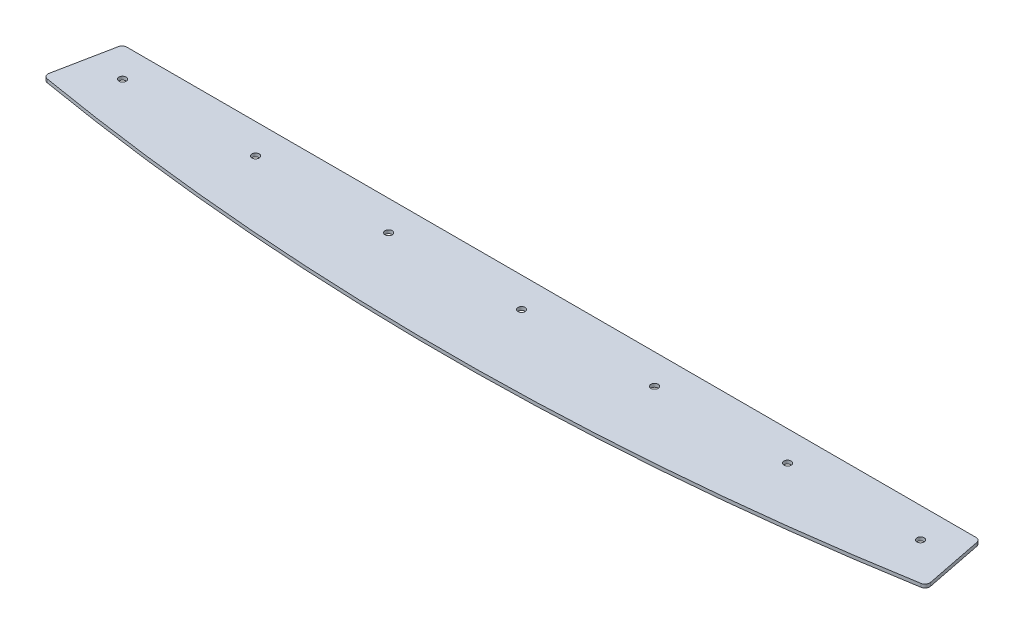
ISO-10303-21;
HEADER;
FILE_DESCRIPTION(('STEP AP214'),'2;1');
FILE_NAME('part.step','',(''),(''),'','','');
FILE_SCHEMA(('AUTOMOTIVE_DESIGN { 1 0 10303 214 1 1 1 1 }'));
ENDSEC;
DATA;
#1=APPLICATION_CONTEXT('core data for automotive mechanical design processes');
#2=APPLICATION_PROTOCOL_DEFINITION('international standard','automotive_design',2000,#1);
#3=PRODUCT_CONTEXT('',#1,'mechanical');
#4=PRODUCT('Part','Part','',(#3));
#5=PRODUCT_RELATED_PRODUCT_CATEGORY('part','',(#4));
#6=PRODUCT_DEFINITION_FORMATION('','',#4);
#7=PRODUCT_DEFINITION_CONTEXT('part definition',#1,'design');
#8=PRODUCT_DEFINITION('design','',#6,#7);
#9=PRODUCT_DEFINITION_SHAPE('','',#8);
#10=(LENGTH_UNIT() NAMED_UNIT(*) SI_UNIT(.MILLI.,.METRE.));
#11=(NAMED_UNIT(*) PLANE_ANGLE_UNIT() SI_UNIT($,.RADIAN.));
#12=(NAMED_UNIT(*) SI_UNIT($,.STERADIAN.) SOLID_ANGLE_UNIT());
#13=UNCERTAINTY_MEASURE_WITH_UNIT(LENGTH_MEASURE(1.E-05),#10,'distance_accuracy_value','');
#14=(GEOMETRIC_REPRESENTATION_CONTEXT(3) GLOBAL_UNCERTAINTY_ASSIGNED_CONTEXT((#13)) GLOBAL_UNIT_ASSIGNED_CONTEXT((#10,
#11,#12)) REPRESENTATION_CONTEXT('',''));
#15=CARTESIAN_POINT('',(0.,0.,0.));
#16=DIRECTION('',(0.,0.,1.));
#17=DIRECTION('',(1.,0.,0.));
#18=AXIS2_PLACEMENT_3D('',#15,#16,#17);
#19=CARTESIAN_POINT('',(2.77555756156289E-13,2.8,-1.99840144432528E-11));
#20=DIRECTION('',(0.,1.,0.));
#21=DIRECTION('',(0.,0.,1.));
#22=AXIS2_PLACEMENT_3D('',#19,#20,#21);
#23=PLANE('',#22);
#24=CARTESIAN_POINT('',(-220.,2.8,2088.42305009828));
#25=DIRECTION('',(0.,1.,0.));
#26=DIRECTION('',(0.,0.,1.));
#27=AXIS2_PLACEMENT_3D('',#24,#25,#26);
#28=CIRCLE('',#27,2.99999999999993);
#29=CARTESIAN_POINT('',(-220.,2.8,2091.42305009828));
#30=VERTEX_POINT('',#29);
#31=EDGE_CURVE('E207',#30,#30,#28,.T.);
#32=ORIENTED_EDGE('',*,*,#31,.F.);
#33=EDGE_LOOP('',(#32));
#34=FACE_BOUND('',#33,.T.);
#35=CARTESIAN_POINT('',(330.,2.8,2088.42305009828));
#36=DIRECTION('',(0.,1.,0.));
#37=DIRECTION('',(0.,0.,1.));
#38=AXIS2_PLACEMENT_3D('',#35,#36,#37);
#39=CIRCLE('',#38,2.99999999999993);
#40=CARTESIAN_POINT('',(330.,2.8,2091.42305009828));
#41=VERTEX_POINT('',#40);
#42=EDGE_CURVE('E195',#41,#41,#39,.T.);
#43=ORIENTED_EDGE('',*,*,#42,.F.);
#44=EDGE_LOOP('',(#43));
#45=FACE_BOUND('',#44,.T.);
#46=CARTESIAN_POINT('',(110.,2.8,2088.42305009828));
#47=DIRECTION('',(0.,1.,0.));
#48=DIRECTION('',(0.,0.,1.));
#49=AXIS2_PLACEMENT_3D('',#46,#47,#48);
#50=CIRCLE('',#49,2.99999999999994);
#51=CARTESIAN_POINT('',(110.,2.8,2091.42305009828));
#52=VERTEX_POINT('',#51);
#53=EDGE_CURVE('E184',#52,#52,#50,.T.);
#54=ORIENTED_EDGE('',*,*,#53,.F.);
#55=EDGE_LOOP('',(#54));
#56=FACE_BOUND('',#55,.T.);
#57=DIRECTION('',(-1.,0.,0.));
#58=VECTOR('',#57,1.);
#59=CARTESIAN_POINT('',(-354.423555472873,2.8,2063.72823661999));
#60=LINE('',#59,#58);
#61=CARTESIAN_POINT('',(351.140840309559,2.8,2063.72823661999));
#62=VERTEX_POINT('',#61);
#63=CARTESIAN_POINT('',(-351.140840309558,2.8,2063.72823661999));
#64=VERTEX_POINT('',#63);
#65=EDGE_CURVE('E170',#62,#64,#60,.T.);
#66=ORIENTED_EDGE('',*,*,#65,.T.);
#67=CARTESIAN_POINT('',(-351.140840309558,2.8,2067.72823661999));
#68=DIRECTION('',(0.,1.,0.));
#69=DIRECTION('',(0.,0.,1.));
#70=AXIS2_PLACEMENT_3D('',#67,#68,#69);
#71=CIRCLE('',#70,4.);
#72=CARTESIAN_POINT('',(-355.063981431171,2.8,2066.94787533193));
#73=VERTEX_POINT('',#72);
#74=EDGE_CURVE('E148',#64,#73,#71,.T.);
#75=ORIENTED_EDGE('',*,*,#74,.T.);
#76=DIRECTION('',(-0.195090322016128,0.,0.98078528040323));
#77=VECTOR('',#76,1.);
#78=CARTESIAN_POINT('',(-354.423555472873,2.8,2063.72823661999));
#79=LINE('',#78,#77);
#80=CARTESIAN_POINT('',(-364.562383916996,2.8,2114.69956926102));
#81=VERTEX_POINT('',#80);
#82=EDGE_CURVE('E118',#73,#81,#79,.T.);
#83=ORIENTED_EDGE('',*,*,#82,.T.);
#84=CARTESIAN_POINT('',(-360.639242795383,2.8,2115.47993054909));
#85=DIRECTION('',(0.,1.,0.));
#86=DIRECTION('',(0.,0.,1.));
#87=AXIS2_PLACEMENT_3D('',#84,#85,#86);
#88=CIRCLE('',#87,4.);
#89=CARTESIAN_POINT('',(-361.311450144489,2.8,2119.42304318758));
#90=VERTEX_POINT('',#89);
#91=EDGE_CURVE('E54',#81,#90,#88,.T.);
#92=ORIENTED_EDGE('',*,*,#91,.T.);
#93=CARTESIAN_POINT('',(2.77555756156289E-13,2.8,-1.99840144432528E-11));
#94=DIRECTION('',(0.,1.,0.));
#95=DIRECTION('',(0.,0.,1.));
#96=AXIS2_PLACEMENT_3D('',#93,#94,#95);
#97=CIRCLE('',#96,2150.00000000002);
#98=CARTESIAN_POINT('',(361.31145014449,2.8,2119.42304318758));
#99=VERTEX_POINT('',#98);
#100=EDGE_CURVE('E134',#90,#99,#97,.T.);
#101=ORIENTED_EDGE('',*,*,#100,.T.);
#102=CARTESIAN_POINT('',(360.639242795384,2.8,2115.47993054909));
#103=DIRECTION('',(0.,1.,0.));
#104=DIRECTION('',(0.,0.,1.));
#105=AXIS2_PLACEMENT_3D('',#102,#103,#104);
#106=CIRCLE('',#105,4.);
#107=CARTESIAN_POINT('',(364.562383916997,2.8,2114.69956926102));
#108=VERTEX_POINT('',#107);
#109=EDGE_CURVE('E144',#99,#108,#106,.T.);
#110=ORIENTED_EDGE('',*,*,#109,.T.);
#111=DIRECTION('',(-0.195090322016128,0.,-0.98078528040323));
#112=VECTOR('',#111,1.);
#113=CARTESIAN_POINT('',(354.423555472874,2.8,2063.72823661999));
#114=LINE('',#113,#112);
#115=CARTESIAN_POINT('',(355.063981431172,2.8,2066.94787533193));
#116=VERTEX_POINT('',#115);
#117=EDGE_CURVE('E128',#108,#116,#114,.T.);
#118=ORIENTED_EDGE('',*,*,#117,.T.);
#119=CARTESIAN_POINT('',(351.140840309559,2.8,2067.72823661999));
#120=DIRECTION('',(0.,1.,0.));
#121=DIRECTION('',(0.,0.,1.));
#122=AXIS2_PLACEMENT_3D('',#119,#120,#121);
#123=CIRCLE('',#122,4.);
#124=EDGE_CURVE('E146',#116,#62,#123,.T.);
#125=ORIENTED_EDGE('',*,*,#124,.T.);
#126=EDGE_LOOP('',(#66,#75,#83,#92,#101,#110,#118,#125));
#127=FACE_BOUND('',#126,.T.);
#128=CARTESIAN_POINT('',(2.77555756156289E-13,2.8,2088.42305009828));
#129=DIRECTION('',(0.,1.,0.));
#130=DIRECTION('',(0.,0.,1.));
#131=AXIS2_PLACEMENT_3D('',#128,#129,#130);
#132=CIRCLE('',#131,2.99999999999994);
#133=CARTESIAN_POINT('',(2.77555756156289E-13,2.8,2091.42305009828));
#134=VERTEX_POINT('',#133);
#135=EDGE_CURVE('E179',#134,#134,#132,.T.);
#136=ORIENTED_EDGE('',*,*,#135,.F.);
#137=EDGE_LOOP('',(#136));
#138=FACE_BOUND('',#137,.T.);
#139=CARTESIAN_POINT('',(220.,2.8,2088.42305009828));
#140=DIRECTION('',(0.,1.,0.));
#141=DIRECTION('',(0.,0.,1.));
#142=AXIS2_PLACEMENT_3D('',#139,#140,#141);
#143=CIRCLE('',#142,2.99999999999993);
#144=CARTESIAN_POINT('',(220.,2.8,2091.42305009828));
#145=VERTEX_POINT('',#144);
#146=EDGE_CURVE('E189',#145,#145,#143,.T.);
#147=ORIENTED_EDGE('',*,*,#146,.F.);
#148=EDGE_LOOP('',(#147));
#149=FACE_BOUND('',#148,.T.);
#150=CARTESIAN_POINT('',(-110.,2.8,2088.42305009828));
#151=DIRECTION('',(0.,1.,0.));
#152=DIRECTION('',(0.,0.,1.));
#153=AXIS2_PLACEMENT_3D('',#150,#151,#152);
#154=CIRCLE('',#153,2.99999999999994);
#155=CARTESIAN_POINT('',(-110.,2.8,2091.42305009828));
#156=VERTEX_POINT('',#155);
#157=EDGE_CURVE('E201',#156,#156,#154,.T.);
#158=ORIENTED_EDGE('',*,*,#157,.F.);
#159=EDGE_LOOP('',(#158));
#160=FACE_BOUND('',#159,.T.);
#161=CARTESIAN_POINT('',(-330.,2.8,2088.42305009828));
#162=DIRECTION('',(0.,1.,0.));
#163=DIRECTION('',(0.,0.,1.));
#164=AXIS2_PLACEMENT_3D('',#161,#162,#163);
#165=CIRCLE('',#164,2.99999999999993);
#166=CARTESIAN_POINT('',(-330.,2.8,2091.42305009828));
#167=VERTEX_POINT('',#166);
#168=EDGE_CURVE('E213',#167,#167,#165,.T.);
#169=ORIENTED_EDGE('',*,*,#168,.F.);
#170=EDGE_LOOP('',(#169));
#171=FACE_BOUND('',#170,.T.);
#172=ADVANCED_FACE('F34',(#34,#45,#56,#127,#138,#149,#160,#171),#23,.T.);
#173=CARTESIAN_POINT('',(2.77555756156289E-13,0.,-1.99840144432528E-11));
#174=DIRECTION('',(0.,1.,0.));
#175=DIRECTION('',(0.,0.,1.));
#176=AXIS2_PLACEMENT_3D('',#173,#174,#175);
#177=PLANE('',#176);
#178=DIRECTION('',(-0.195090322016128,0.,0.98078528040323));
#179=VECTOR('',#178,1.);
#180=CARTESIAN_POINT('',(-354.423555472873,0.,2063.72823661999));
#181=LINE('',#180,#179);
#182=CARTESIAN_POINT('',(-355.063981431171,0.,2066.94787533193));
#183=VERTEX_POINT('',#182);
#184=CARTESIAN_POINT('',(-364.562383916996,0.,2114.69956926102));
#185=VERTEX_POINT('',#184);
#186=EDGE_CURVE('E116',#183,#185,#181,.T.);
#187=ORIENTED_EDGE('',*,*,#186,.F.);
#188=CARTESIAN_POINT('',(-351.140840309558,0.,2067.72823661999));
#189=DIRECTION('',(0.,1.,0.));
#190=DIRECTION('',(0.,0.,1.));
#191=AXIS2_PLACEMENT_3D('',#188,#189,#190);
#192=CIRCLE('',#191,4.);
#193=CARTESIAN_POINT('',(-351.140840309558,0.,2063.72823661999));
#194=VERTEX_POINT('',#193);
#195=EDGE_CURVE('E99',#183,#194,#192,.F.);
#196=ORIENTED_EDGE('',*,*,#195,.T.);
#197=DIRECTION('',(-1.,0.,0.));
#198=VECTOR('',#197,1.);
#199=CARTESIAN_POINT('',(-354.423555472873,0.,2063.72823661999));
#200=LINE('',#199,#198);
#201=CARTESIAN_POINT('',(351.140840309559,0.,2063.72823661999));
#202=VERTEX_POINT('',#201);
#203=EDGE_CURVE('E126',#202,#194,#200,.T.);
#204=ORIENTED_EDGE('',*,*,#203,.F.);
#205=CARTESIAN_POINT('',(351.140840309559,0.,2067.72823661999));
#206=DIRECTION('',(0.,1.,0.));
#207=DIRECTION('',(0.,0.,1.));
#208=AXIS2_PLACEMENT_3D('',#205,#206,#207);
#209=CIRCLE('',#208,4.);
#210=CARTESIAN_POINT('',(355.063981431172,0.,2066.94787533193));
#211=VERTEX_POINT('',#210);
#212=EDGE_CURVE('E110',#202,#211,#209,.F.);
#213=ORIENTED_EDGE('',*,*,#212,.T.);
#214=DIRECTION('',(-0.195090322016128,0.,-0.98078528040323));
#215=VECTOR('',#214,1.);
#216=CARTESIAN_POINT('',(354.423555472874,0.,2063.72823661999));
#217=LINE('',#216,#215);
#218=CARTESIAN_POINT('',(364.562383916997,0.,2114.69956926102));
#219=VERTEX_POINT('',#218);
#220=EDGE_CURVE('E130',#219,#211,#217,.T.);
#221=ORIENTED_EDGE('',*,*,#220,.F.);
#222=CARTESIAN_POINT('',(360.639242795384,0.,2115.47993054909));
#223=DIRECTION('',(0.,1.,0.));
#224=DIRECTION('',(0.,0.,1.));
#225=AXIS2_PLACEMENT_3D('',#222,#223,#224);
#226=CIRCLE('',#225,4.);
#227=CARTESIAN_POINT('',(361.31145014449,0.,2119.42304318758));
#228=VERTEX_POINT('',#227);
#229=EDGE_CURVE('E137',#219,#228,#226,.F.);
#230=ORIENTED_EDGE('',*,*,#229,.T.);
#231=CARTESIAN_POINT('',(2.77555756156289E-13,0.,-1.99840144432528E-11));
#232=DIRECTION('',(0.,1.,0.));
#233=DIRECTION('',(0.,0.,1.));
#234=AXIS2_PLACEMENT_3D('',#231,#232,#233);
#235=CIRCLE('',#234,2150.00000000002);
#236=CARTESIAN_POINT('',(-361.311450144489,0.,2119.42304318758));
#237=VERTEX_POINT('',#236);
#238=EDGE_CURVE('E125',#237,#228,#235,.T.);
#239=ORIENTED_EDGE('',*,*,#238,.F.);
#240=CARTESIAN_POINT('',(-360.639242795383,0.,2115.47993054909));
#241=DIRECTION('',(0.,1.,0.));
#242=DIRECTION('',(0.,0.,1.));
#243=AXIS2_PLACEMENT_3D('',#240,#241,#242);
#244=CIRCLE('',#243,4.);
#245=EDGE_CURVE('E119',#237,#185,#244,.F.);
#246=ORIENTED_EDGE('',*,*,#245,.T.);
#247=EDGE_LOOP('',(#187,#196,#204,#213,#221,#230,#239,#246));
#248=FACE_BOUND('',#247,.T.);
#249=CARTESIAN_POINT('',(2.77555756156289E-13,0.,2088.42305009828));
#250=DIRECTION('',(0.,1.,0.));
#251=DIRECTION('',(0.,0.,1.));
#252=AXIS2_PLACEMENT_3D('',#249,#250,#251);
#253=CIRCLE('',#252,2.99999999999994);
#254=CARTESIAN_POINT('',(2.77555756156289E-13,0.,2091.42305009828));
#255=VERTEX_POINT('',#254);
#256=EDGE_CURVE('E175',#255,#255,#253,.T.);
#257=ORIENTED_EDGE('',*,*,#256,.T.);
#258=EDGE_LOOP('',(#257));
#259=FACE_BOUND('',#258,.T.);
#260=CARTESIAN_POINT('',(110.,0.,2088.42305009828));
#261=DIRECTION('',(0.,1.,0.));
#262=DIRECTION('',(0.,0.,1.));
#263=AXIS2_PLACEMENT_3D('',#260,#261,#262);
#264=CIRCLE('',#263,2.99999999999994);
#265=CARTESIAN_POINT('',(110.,0.,2091.42305009828));
#266=VERTEX_POINT('',#265);
#267=EDGE_CURVE('E186',#266,#266,#264,.T.);
#268=ORIENTED_EDGE('',*,*,#267,.T.);
#269=EDGE_LOOP('',(#268));
#270=FACE_BOUND('',#269,.T.);
#271=CARTESIAN_POINT('',(220.,0.,2088.42305009828));
#272=DIRECTION('',(0.,1.,0.));
#273=DIRECTION('',(0.,0.,1.));
#274=AXIS2_PLACEMENT_3D('',#271,#272,#273);
#275=CIRCLE('',#274,2.99999999999993);
#276=CARTESIAN_POINT('',(220.,0.,2091.42305009828));
#277=VERTEX_POINT('',#276);
#278=EDGE_CURVE('E192',#277,#277,#275,.T.);
#279=ORIENTED_EDGE('',*,*,#278,.T.);
#280=EDGE_LOOP('',(#279));
#281=FACE_BOUND('',#280,.T.);
#282=CARTESIAN_POINT('',(330.,0.,2088.42305009828));
#283=DIRECTION('',(0.,1.,0.));
#284=DIRECTION('',(0.,0.,1.));
#285=AXIS2_PLACEMENT_3D('',#282,#283,#284);
#286=CIRCLE('',#285,2.99999999999993);
#287=CARTESIAN_POINT('',(330.,0.,2091.42305009828));
#288=VERTEX_POINT('',#287);
#289=EDGE_CURVE('E198',#288,#288,#286,.T.);
#290=ORIENTED_EDGE('',*,*,#289,.T.);
#291=EDGE_LOOP('',(#290));
#292=FACE_BOUND('',#291,.T.);
#293=CARTESIAN_POINT('',(-110.,0.,2088.42305009828));
#294=DIRECTION('',(0.,1.,0.));
#295=DIRECTION('',(0.,0.,1.));
#296=AXIS2_PLACEMENT_3D('',#293,#294,#295);
#297=CIRCLE('',#296,2.99999999999994);
#298=CARTESIAN_POINT('',(-110.,0.,2091.42305009828));
#299=VERTEX_POINT('',#298);
#300=EDGE_CURVE('E204',#299,#299,#297,.T.);
#301=ORIENTED_EDGE('',*,*,#300,.T.);
#302=EDGE_LOOP('',(#301));
#303=FACE_BOUND('',#302,.T.);
#304=CARTESIAN_POINT('',(-220.,0.,2088.42305009828));
#305=DIRECTION('',(0.,1.,0.));
#306=DIRECTION('',(0.,0.,1.));
#307=AXIS2_PLACEMENT_3D('',#304,#305,#306);
#308=CIRCLE('',#307,2.99999999999993);
#309=CARTESIAN_POINT('',(-220.,0.,2091.42305009828));
#310=VERTEX_POINT('',#309);
#311=EDGE_CURVE('E210',#310,#310,#308,.T.);
#312=ORIENTED_EDGE('',*,*,#311,.T.);
#313=EDGE_LOOP('',(#312));
#314=FACE_BOUND('',#313,.T.);
#315=CARTESIAN_POINT('',(-330.,0.,2088.42305009828));
#316=DIRECTION('',(0.,1.,0.));
#317=DIRECTION('',(0.,0.,1.));
#318=AXIS2_PLACEMENT_3D('',#315,#316,#317);
#319=CIRCLE('',#318,2.99999999999993);
#320=CARTESIAN_POINT('',(-330.,0.,2091.42305009828));
#321=VERTEX_POINT('',#320);
#322=EDGE_CURVE('E216',#321,#321,#319,.T.);
#323=ORIENTED_EDGE('',*,*,#322,.T.);
#324=EDGE_LOOP('',(#323));
#325=FACE_BOUND('',#324,.T.);
#326=ADVANCED_FACE('F122',(#248,#259,#270,#281,#292,#303,#314,#325),#177,.F.);
#327=CARTESIAN_POINT('',(354.423555472874,2.8,2063.72823661999));
#328=DIRECTION('',(-0.980785280403231,0.,0.195090322016128));
#329=DIRECTION('',(0.195090322016128,0.,0.980785280403231));
#330=AXIS2_PLACEMENT_3D('',#327,#328,#329);
#331=PLANE('',#330);
#332=ORIENTED_EDGE('',*,*,#220,.T.);
#333=DIRECTION('',(0.,-1.,0.));
#334=VECTOR('',#333,1.);
#335=CARTESIAN_POINT('',(355.063981431172,2.8,2066.94787533193));
#336=LINE('',#335,#334);
#337=EDGE_CURVE('E153',#211,#116,#336,.F.);
#338=ORIENTED_EDGE('',*,*,#337,.T.);
#339=ORIENTED_EDGE('',*,*,#117,.F.);
#340=DIRECTION('',(0.,-1.,0.));
#341=VECTOR('',#340,1.);
#342=CARTESIAN_POINT('',(364.562383916997,2.8,2114.69956926102));
#343=LINE('',#342,#341);
#344=EDGE_CURVE('E150',#108,#219,#343,.T.);
#345=ORIENTED_EDGE('',*,*,#344,.T.);
#346=EDGE_LOOP('',(#332,#338,#339,#345));
#347=FACE_BOUND('',#346,.T.);
#348=ADVANCED_FACE('F166',(#347),#331,.F.);
#349=CARTESIAN_POINT('',(-354.423555472873,2.8,2063.72823661999));
#350=DIRECTION('',(0.,0.,1.));
#351=DIRECTION('',(1.,0.,0.));
#352=AXIS2_PLACEMENT_3D('',#349,#350,#351);
#353=PLANE('',#352);
#354=ORIENTED_EDGE('',*,*,#203,.T.);
#355=DIRECTION('',(0.,-1.,0.));
#356=VECTOR('',#355,1.);
#357=CARTESIAN_POINT('',(-351.140840309558,2.8,2063.72823661999));
#358=LINE('',#357,#356);
#359=EDGE_CURVE('E104',#194,#64,#358,.F.);
#360=ORIENTED_EDGE('',*,*,#359,.T.);
#361=ORIENTED_EDGE('',*,*,#65,.F.);
#362=DIRECTION('',(0.,-1.,0.));
#363=VECTOR('',#362,1.);
#364=CARTESIAN_POINT('',(351.140840309559,2.8,2063.72823661999));
#365=LINE('',#364,#363);
#366=EDGE_CURVE('E109',#62,#202,#365,.T.);
#367=ORIENTED_EDGE('',*,*,#366,.T.);
#368=EDGE_LOOP('',(#354,#360,#361,#367));
#369=FACE_BOUND('',#368,.T.);
#370=ADVANCED_FACE('F242',(#369),#353,.F.);
#371=CARTESIAN_POINT('',(-354.423555472873,2.8,2063.72823661999));
#372=DIRECTION('',(0.980785280403231,0.,0.195090322016128));
#373=DIRECTION('',(0.195090322016128,0.,-0.980785280403231));
#374=AXIS2_PLACEMENT_3D('',#371,#372,#373);
#375=PLANE('',#374);
#376=ORIENTED_EDGE('',*,*,#82,.F.);
#377=DIRECTION('',(0.,-1.,0.));
#378=VECTOR('',#377,1.);
#379=CARTESIAN_POINT('',(-355.063981431171,2.8,2066.94787533193));
#380=LINE('',#379,#378);
#381=EDGE_CURVE('E103',#73,#183,#380,.T.);
#382=ORIENTED_EDGE('',*,*,#381,.T.);
#383=ORIENTED_EDGE('',*,*,#186,.T.);
#384=DIRECTION('',(0.,-1.,0.));
#385=VECTOR('',#384,1.);
#386=CARTESIAN_POINT('',(-364.562383916996,2.8,2114.69956926102));
#387=LINE('',#386,#385);
#388=EDGE_CURVE('E120',#185,#81,#387,.F.);
#389=ORIENTED_EDGE('',*,*,#388,.T.);
#390=EDGE_LOOP('',(#376,#382,#383,#389));
#391=FACE_BOUND('',#390,.T.);
#392=ADVANCED_FACE('F115',(#391),#375,.F.);
#393=CARTESIAN_POINT('',(2.77555756156289E-13,2.8,-1.99840144432528E-11));
#394=DIRECTION('',(0.,-1.,0.));
#395=DIRECTION('',(0.,0.,-1.));
#396=AXIS2_PLACEMENT_3D('',#393,#394,#395);
#397=CYLINDRICAL_SURFACE('',#396,2150.00000000002);
#398=ORIENTED_EDGE('',*,*,#238,.T.);
#399=DIRECTION('',(0.,-1.,0.));
#400=VECTOR('',#399,1.);
#401=CARTESIAN_POINT('',(361.31145014449,2.8,2119.42304318758));
#402=LINE('',#401,#400);
#403=EDGE_CURVE('E11',#228,#99,#402,.F.);
#404=ORIENTED_EDGE('',*,*,#403,.T.);
#405=ORIENTED_EDGE('',*,*,#100,.F.);
#406=DIRECTION('',(0.,-1.,0.));
#407=VECTOR('',#406,1.);
#408=CARTESIAN_POINT('',(-361.311450144489,2.8,2119.42304318758));
#409=LINE('',#408,#407);
#410=EDGE_CURVE('E42',#90,#237,#409,.T.);
#411=ORIENTED_EDGE('',*,*,#410,.T.);
#412=EDGE_LOOP('',(#398,#404,#405,#411));
#413=FACE_BOUND('',#412,.T.);
#414=ADVANCED_FACE('F156',(#413),#397,.T.);
#415=CARTESIAN_POINT('',(2.77555756156289E-13,2.8,2088.42305009828));
#416=DIRECTION('',(0.,-1.,0.));
#417=DIRECTION('',(0.,0.,-1.));
#418=AXIS2_PLACEMENT_3D('',#415,#416,#417);
#419=CYLINDRICAL_SURFACE('',#418,2.99999999999994);
#420=ORIENTED_EDGE('',*,*,#135,.T.);
#421=EDGE_LOOP('',(#420));
#422=FACE_BOUND('',#421,.T.);
#423=ORIENTED_EDGE('',*,*,#256,.F.);
#424=EDGE_LOOP('',(#423));
#425=FACE_BOUND('',#424,.T.);
#426=ADVANCED_FACE('F235',(#422,#425),#419,.F.);
#427=CARTESIAN_POINT('',(110.,2.8,2088.42305009828));
#428=DIRECTION('',(0.,-1.,0.));
#429=DIRECTION('',(0.,0.,-1.));
#430=AXIS2_PLACEMENT_3D('',#427,#428,#429);
#431=CYLINDRICAL_SURFACE('',#430,2.99999999999994);
#432=ORIENTED_EDGE('',*,*,#53,.T.);
#433=EDGE_LOOP('',(#432));
#434=FACE_BOUND('',#433,.T.);
#435=ORIENTED_EDGE('',*,*,#267,.F.);
#436=EDGE_LOOP('',(#435));
#437=FACE_BOUND('',#436,.T.);
#438=ADVANCED_FACE('F292',(#434,#437),#431,.F.);
#439=CARTESIAN_POINT('',(220.,2.8,2088.42305009828));
#440=DIRECTION('',(0.,-1.,0.));
#441=DIRECTION('',(0.,0.,-1.));
#442=AXIS2_PLACEMENT_3D('',#439,#440,#441);
#443=CYLINDRICAL_SURFACE('',#442,2.99999999999993);
#444=ORIENTED_EDGE('',*,*,#146,.T.);
#445=EDGE_LOOP('',(#444));
#446=FACE_BOUND('',#445,.T.);
#447=ORIENTED_EDGE('',*,*,#278,.F.);
#448=EDGE_LOOP('',(#447));
#449=FACE_BOUND('',#448,.T.);
#450=ADVANCED_FACE('F289',(#446,#449),#443,.F.);
#451=CARTESIAN_POINT('',(330.,2.8,2088.42305009828));
#452=DIRECTION('',(0.,-1.,0.));
#453=DIRECTION('',(0.,0.,-1.));
#454=AXIS2_PLACEMENT_3D('',#451,#452,#453);
#455=CYLINDRICAL_SURFACE('',#454,2.99999999999993);
#456=ORIENTED_EDGE('',*,*,#42,.T.);
#457=EDGE_LOOP('',(#456));
#458=FACE_BOUND('',#457,.T.);
#459=ORIENTED_EDGE('',*,*,#289,.F.);
#460=EDGE_LOOP('',(#459));
#461=FACE_BOUND('',#460,.T.);
#462=ADVANCED_FACE('F271',(#458,#461),#455,.F.);
#463=CARTESIAN_POINT('',(-110.,2.8,2088.42305009828));
#464=DIRECTION('',(0.,-1.,0.));
#465=DIRECTION('',(0.,0.,-1.));
#466=AXIS2_PLACEMENT_3D('',#463,#464,#465);
#467=CYLINDRICAL_SURFACE('',#466,2.99999999999994);
#468=ORIENTED_EDGE('',*,*,#157,.T.);
#469=EDGE_LOOP('',(#468));
#470=FACE_BOUND('',#469,.T.);
#471=ORIENTED_EDGE('',*,*,#300,.F.);
#472=EDGE_LOOP('',(#471));
#473=FACE_BOUND('',#472,.T.);
#474=ADVANCED_FACE('F267',(#470,#473),#467,.F.);
#475=CARTESIAN_POINT('',(-220.,2.8,2088.42305009828));
#476=DIRECTION('',(0.,-1.,0.));
#477=DIRECTION('',(0.,0.,-1.));
#478=AXIS2_PLACEMENT_3D('',#475,#476,#477);
#479=CYLINDRICAL_SURFACE('',#478,2.99999999999993);
#480=ORIENTED_EDGE('',*,*,#31,.T.);
#481=EDGE_LOOP('',(#480));
#482=FACE_BOUND('',#481,.T.);
#483=ORIENTED_EDGE('',*,*,#311,.F.);
#484=EDGE_LOOP('',(#483));
#485=FACE_BOUND('',#484,.T.);
#486=ADVANCED_FACE('F270',(#482,#485),#479,.F.);
#487=CARTESIAN_POINT('',(-330.,2.8,2088.42305009828));
#488=DIRECTION('',(0.,-1.,0.));
#489=DIRECTION('',(0.,0.,-1.));
#490=AXIS2_PLACEMENT_3D('',#487,#488,#489);
#491=CYLINDRICAL_SURFACE('',#490,2.99999999999993);
#492=ORIENTED_EDGE('',*,*,#168,.T.);
#493=EDGE_LOOP('',(#492));
#494=FACE_BOUND('',#493,.T.);
#495=ORIENTED_EDGE('',*,*,#322,.F.);
#496=EDGE_LOOP('',(#495));
#497=FACE_BOUND('',#496,.T.);
#498=ADVANCED_FACE('F222',(#494,#497),#491,.F.);
#499=CARTESIAN_POINT('',(-351.140840309558,2.8,2067.72823661999));
#500=DIRECTION('',(0.,-1.,0.));
#501=DIRECTION('',(0.,0.,-1.));
#502=AXIS2_PLACEMENT_3D('',#499,#500,#501);
#503=CYLINDRICAL_SURFACE('',#502,4.);
#504=ORIENTED_EDGE('',*,*,#74,.F.);
#505=ORIENTED_EDGE('',*,*,#359,.F.);
#506=ORIENTED_EDGE('',*,*,#195,.F.);
#507=ORIENTED_EDGE('',*,*,#381,.F.);
#508=EDGE_LOOP('',(#504,#505,#506,#507));
#509=FACE_BOUND('',#508,.T.);
#510=ADVANCED_FACE('F102',(#509),#503,.T.);
#511=CARTESIAN_POINT('',(351.140840309559,2.8,2067.72823661999));
#512=DIRECTION('',(0.,-1.,0.));
#513=DIRECTION('',(0.,0.,-1.));
#514=AXIS2_PLACEMENT_3D('',#511,#512,#513);
#515=CYLINDRICAL_SURFACE('',#514,4.);
#516=ORIENTED_EDGE('',*,*,#124,.F.);
#517=ORIENTED_EDGE('',*,*,#337,.F.);
#518=ORIENTED_EDGE('',*,*,#212,.F.);
#519=ORIENTED_EDGE('',*,*,#366,.F.);
#520=EDGE_LOOP('',(#516,#517,#518,#519));
#521=FACE_BOUND('',#520,.T.);
#522=ADVANCED_FACE('F250',(#521),#515,.T.);
#523=CARTESIAN_POINT('',(360.639242795384,2.8,2115.47993054909));
#524=DIRECTION('',(0.,-1.,0.));
#525=DIRECTION('',(0.,0.,-1.));
#526=AXIS2_PLACEMENT_3D('',#523,#524,#525);
#527=CYLINDRICAL_SURFACE('',#526,4.);
#528=ORIENTED_EDGE('',*,*,#109,.F.);
#529=ORIENTED_EDGE('',*,*,#403,.F.);
#530=ORIENTED_EDGE('',*,*,#229,.F.);
#531=ORIENTED_EDGE('',*,*,#344,.F.);
#532=EDGE_LOOP('',(#528,#529,#530,#531));
#533=FACE_BOUND('',#532,.T.);
#534=ADVANCED_FACE('F163',(#533),#527,.T.);
#535=CARTESIAN_POINT('',(-360.639242795383,2.8,2115.47993054909));
#536=DIRECTION('',(0.,-1.,0.));
#537=DIRECTION('',(0.,0.,-1.));
#538=AXIS2_PLACEMENT_3D('',#535,#536,#537);
#539=CYLINDRICAL_SURFACE('',#538,4.);
#540=ORIENTED_EDGE('',*,*,#91,.F.);
#541=ORIENTED_EDGE('',*,*,#388,.F.);
#542=ORIENTED_EDGE('',*,*,#245,.F.);
#543=ORIENTED_EDGE('',*,*,#410,.F.);
#544=EDGE_LOOP('',(#540,#541,#542,#543));
#545=FACE_BOUND('',#544,.T.);
#546=ADVANCED_FACE('F36',(#545),#539,.T.);
#547=CLOSED_SHELL('',(#172,#326,#348,#370,#392,#414,#426,#438,#450,#462,#474,#486,#498,#510,
#522,#534,#546));
#548=MANIFOLD_SOLID_BREP('B2',#547);
#549=ADVANCED_BREP_SHAPE_REPRESENTATION('',(#18,#548),#14);
#550=SHAPE_DEFINITION_REPRESENTATION(#9,#549);
ENDSEC;
END-ISO-10303-21;
